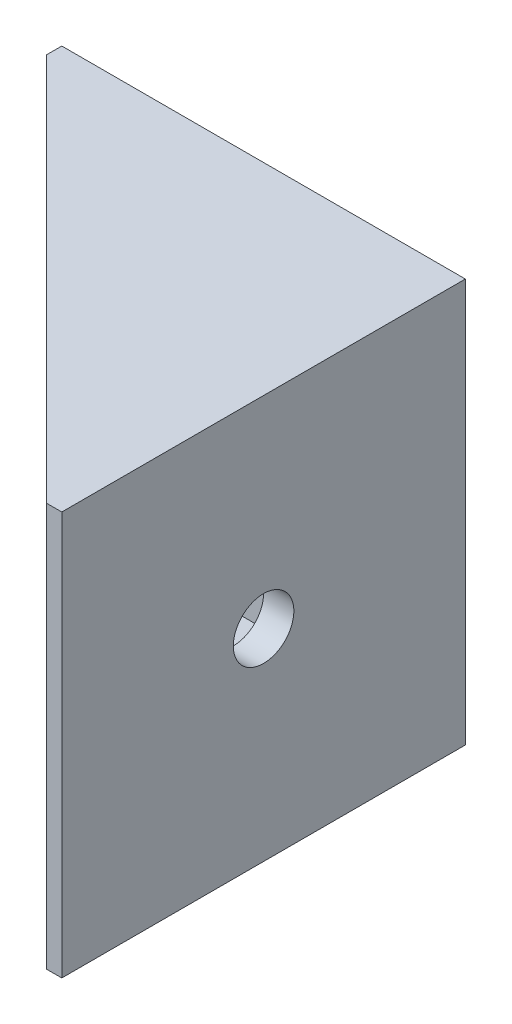
ISO-10303-21;
HEADER;
FILE_DESCRIPTION(('STEP AP214'),'2;1');
FILE_NAME('part.step','',(''),(''),'','','');
FILE_SCHEMA(('AUTOMOTIVE_DESIGN { 1 0 10303 214 1 1 1 1 }'));
ENDSEC;
DATA;
#1=APPLICATION_CONTEXT('core data for automotive mechanical design processes');
#2=APPLICATION_PROTOCOL_DEFINITION('international standard','automotive_design',2000,#1);
#3=PRODUCT_CONTEXT('',#1,'mechanical');
#4=PRODUCT('Part','Part','',(#3));
#5=PRODUCT_RELATED_PRODUCT_CATEGORY('part','',(#4));
#6=PRODUCT_DEFINITION_FORMATION('','',#4);
#7=PRODUCT_DEFINITION_CONTEXT('part definition',#1,'design');
#8=PRODUCT_DEFINITION('design','',#6,#7);
#9=PRODUCT_DEFINITION_SHAPE('','',#8);
#10=(LENGTH_UNIT() NAMED_UNIT(*) SI_UNIT(.MILLI.,.METRE.));
#11=(NAMED_UNIT(*) PLANE_ANGLE_UNIT() SI_UNIT($,.RADIAN.));
#12=(NAMED_UNIT(*) SI_UNIT($,.STERADIAN.) SOLID_ANGLE_UNIT());
#13=UNCERTAINTY_MEASURE_WITH_UNIT(LENGTH_MEASURE(1.E-05),#10,'distance_accuracy_value','');
#14=(GEOMETRIC_REPRESENTATION_CONTEXT(3) GLOBAL_UNCERTAINTY_ASSIGNED_CONTEXT((#13)) GLOBAL_UNIT_ASSIGNED_CONTEXT((#10,
#11,#12)) REPRESENTATION_CONTEXT('',''));
#15=CARTESIAN_POINT('',(0.,0.,0.));
#16=DIRECTION('',(0.,0.,1.));
#17=DIRECTION('',(1.,0.,0.));
#18=AXIS2_PLACEMENT_3D('',#15,#16,#17);
#19=CARTESIAN_POINT('',(-38.5,20.,3.));
#20=DIRECTION('',(0.,0.,-1.));
#21=DIRECTION('',(-1.,0.,0.));
#22=AXIS2_PLACEMENT_3D('',#19,#20,#21);
#23=PLANE('',#22);
#24=CARTESIAN_POINT('',(-20.,0.,3.00000000000001));
#25=DIRECTION('',(0.,0.,-1.));
#26=DIRECTION('',(-1.,0.,0.));
#27=AXIS2_PLACEMENT_3D('',#24,#25,#26);
#28=CIRCLE('',#27,3.);
#29=CARTESIAN_POINT('',(-23.,0.,3.00000000000001));
#30=VERTEX_POINT('',#29);
#31=EDGE_CURVE('E124',#30,#30,#28,.T.);
#32=ORIENTED_EDGE('',*,*,#31,.T.);
#33=EDGE_LOOP('',(#32));
#34=FACE_BOUND('',#33,.T.);
#35=DIRECTION('',(1.,0.,0.));
#36=VECTOR('',#35,1.);
#37=CARTESIAN_POINT('',(-3.00000000000001,17.,3.));
#38=LINE('',#37,#36);
#39=CARTESIAN_POINT('',(-38.5,17.,3.));
#40=VERTEX_POINT('',#39);
#41=CARTESIAN_POINT('',(-3.00000000000001,17.,3.));
#42=VERTEX_POINT('',#41);
#43=EDGE_CURVE('E104',#40,#42,#38,.T.);
#44=ORIENTED_EDGE('',*,*,#43,.F.);
#45=DIRECTION('',(0.,-1.,0.));
#46=VECTOR('',#45,1.);
#47=CARTESIAN_POINT('',(-38.5,20.,3.));
#48=LINE('',#47,#46);
#49=CARTESIAN_POINT('',(-38.5,-17.,3.));
#50=VERTEX_POINT('',#49);
#51=EDGE_CURVE('E50',#40,#50,#48,.T.);
#52=ORIENTED_EDGE('',*,*,#51,.T.);
#53=DIRECTION('',(1.,0.,0.));
#54=VECTOR('',#53,1.);
#55=CARTESIAN_POINT('',(-3.00000000000001,-17.,3.));
#56=LINE('',#55,#54);
#57=CARTESIAN_POINT('',(-3.00000000000001,-17.,3.));
#58=VERTEX_POINT('',#57);
#59=EDGE_CURVE('E172',#50,#58,#56,.T.);
#60=ORIENTED_EDGE('',*,*,#59,.T.);
#61=DIRECTION('',(0.,-1.,0.));
#62=VECTOR('',#61,1.);
#63=CARTESIAN_POINT('',(-3.00000000000001,20.,3.));
#64=LINE('',#63,#62);
#65=EDGE_CURVE('E58',#42,#58,#64,.T.);
#66=ORIENTED_EDGE('',*,*,#65,.F.);
#67=EDGE_LOOP('',(#44,#52,#60,#66));
#68=FACE_BOUND('',#67,.T.);
#69=ADVANCED_FACE('F33',(#34,#68),#23,.F.);
#70=CARTESIAN_POINT('',(-3.00000000000001,20.,3.));
#71=DIRECTION('',(1.,0.,0.));
#72=DIRECTION('',(0.,0.,-1.));
#73=AXIS2_PLACEMENT_3D('',#70,#71,#72);
#74=PLANE('',#73);
#75=CARTESIAN_POINT('',(-3.00000000000001,0.,20.));
#76=DIRECTION('',(1.,0.,0.));
#77=DIRECTION('',(0.,0.,-1.));
#78=AXIS2_PLACEMENT_3D('',#75,#76,#77);
#79=CIRCLE('',#78,3.);
#80=CARTESIAN_POINT('',(-3.00000000000001,0.,17.));
#81=VERTEX_POINT('',#80);
#82=EDGE_CURVE('E37',#81,#81,#79,.T.);
#83=ORIENTED_EDGE('',*,*,#82,.T.);
#84=EDGE_LOOP('',(#83));
#85=FACE_BOUND('',#84,.T.);
#86=DIRECTION('',(0.,0.,1.));
#87=VECTOR('',#86,1.);
#88=CARTESIAN_POINT('',(-3.,17.,38.5));
#89=LINE('',#88,#87);
#90=CARTESIAN_POINT('',(-3.,17.,38.5));
#91=VERTEX_POINT('',#90);
#92=EDGE_CURVE('E105',#42,#91,#89,.T.);
#93=ORIENTED_EDGE('',*,*,#92,.F.);
#94=ORIENTED_EDGE('',*,*,#65,.T.);
#95=DIRECTION('',(0.,0.,1.));
#96=VECTOR('',#95,1.);
#97=CARTESIAN_POINT('',(-3.,-17.,38.5));
#98=LINE('',#97,#96);
#99=CARTESIAN_POINT('',(-3.,-17.,38.5));
#100=VERTEX_POINT('',#99);
#101=EDGE_CURVE('E169',#58,#100,#98,.T.);
#102=ORIENTED_EDGE('',*,*,#101,.T.);
#103=DIRECTION('',(0.,-1.,0.));
#104=VECTOR('',#103,1.);
#105=CARTESIAN_POINT('',(-3.,20.,38.5));
#106=LINE('',#105,#104);
#107=EDGE_CURVE('E119',#91,#100,#106,.T.);
#108=ORIENTED_EDGE('',*,*,#107,.F.);
#109=EDGE_LOOP('',(#93,#94,#102,#108));
#110=FACE_BOUND('',#109,.T.);
#111=ADVANCED_FACE('F170',(#85,#110),#74,.F.);
#112=CARTESIAN_POINT('',(0.,20.,40.));
#113=DIRECTION('',(-1.,0.,0.));
#114=DIRECTION('',(0.,0.,1.));
#115=AXIS2_PLACEMENT_3D('',#112,#113,#114);
#116=PLANE('',#115);
#117=CARTESIAN_POINT('',(0.,0.,20.));
#118=DIRECTION('',(-1.,0.,0.));
#119=DIRECTION('',(0.,0.,1.));
#120=AXIS2_PLACEMENT_3D('',#117,#118,#119);
#121=CIRCLE('',#120,3.);
#122=CARTESIAN_POINT('',(0.,0.,23.));
#123=VERTEX_POINT('',#122);
#124=EDGE_CURVE('E127',#123,#123,#121,.T.);
#125=ORIENTED_EDGE('',*,*,#124,.T.);
#126=EDGE_LOOP('',(#125));
#127=FACE_BOUND('',#126,.T.);
#128=DIRECTION('',(0.,0.,-1.));
#129=VECTOR('',#128,1.);
#130=CARTESIAN_POINT('',(0.,-20.,40.));
#131=LINE('',#130,#129);
#132=CARTESIAN_POINT('',(0.,-20.,40.));
#133=VERTEX_POINT('',#132);
#134=CARTESIAN_POINT('',(0.,-20.,0.));
#135=VERTEX_POINT('',#134);
#136=EDGE_CURVE('E131',#133,#135,#131,.T.);
#137=ORIENTED_EDGE('',*,*,#136,.T.);
#138=DIRECTION('',(0.,-1.,0.));
#139=VECTOR('',#138,1.);
#140=CARTESIAN_POINT('',(0.,20.,0.));
#141=LINE('',#140,#139);
#142=CARTESIAN_POINT('',(0.,20.,0.));
#143=VERTEX_POINT('',#142);
#144=EDGE_CURVE('E11',#143,#135,#141,.T.);
#145=ORIENTED_EDGE('',*,*,#144,.F.);
#146=DIRECTION('',(0.,0.,-1.));
#147=VECTOR('',#146,1.);
#148=CARTESIAN_POINT('',(0.,20.,40.));
#149=LINE('',#148,#147);
#150=CARTESIAN_POINT('',(0.,20.,40.));
#151=VERTEX_POINT('',#150);
#152=EDGE_CURVE('E141',#151,#143,#149,.T.);
#153=ORIENTED_EDGE('',*,*,#152,.F.);
#154=DIRECTION('',(0.,-1.,0.));
#155=VECTOR('',#154,1.);
#156=CARTESIAN_POINT('',(0.,20.,40.));
#157=LINE('',#156,#155);
#158=EDGE_CURVE('E153',#151,#133,#157,.T.);
#159=ORIENTED_EDGE('',*,*,#158,.T.);
#160=EDGE_LOOP('',(#137,#145,#153,#159));
#161=FACE_BOUND('',#160,.T.);
#162=ADVANCED_FACE('F35',(#127,#161),#116,.F.);
#163=CARTESIAN_POINT('',(0.,20.,0.));
#164=DIRECTION('',(0.,0.,1.));
#165=DIRECTION('',(1.,0.,0.));
#166=AXIS2_PLACEMENT_3D('',#163,#164,#165);
#167=PLANE('',#166);
#168=CARTESIAN_POINT('',(-20.,0.,0.));
#169=DIRECTION('',(0.,0.,1.));
#170=DIRECTION('',(1.,0.,0.));
#171=AXIS2_PLACEMENT_3D('',#168,#169,#170);
#172=CIRCLE('',#171,3.);
#173=CARTESIAN_POINT('',(-17.,0.,0.));
#174=VERTEX_POINT('',#173);
#175=EDGE_CURVE('E126',#174,#174,#172,.T.);
#176=ORIENTED_EDGE('',*,*,#175,.T.);
#177=EDGE_LOOP('',(#176));
#178=FACE_BOUND('',#177,.T.);
#179=DIRECTION('',(-1.,0.,0.));
#180=VECTOR('',#179,1.);
#181=CARTESIAN_POINT('',(0.,-20.,0.));
#182=LINE('',#181,#180);
#183=CARTESIAN_POINT('',(-40.,-20.,0.));
#184=VERTEX_POINT('',#183);
#185=EDGE_CURVE('E156',#135,#184,#182,.T.);
#186=ORIENTED_EDGE('',*,*,#185,.T.);
#187=DIRECTION('',(0.,-1.,0.));
#188=VECTOR('',#187,1.);
#189=CARTESIAN_POINT('',(-40.,20.,0.));
#190=LINE('',#189,#188);
#191=CARTESIAN_POINT('',(-40.,20.,0.));
#192=VERTEX_POINT('',#191);
#193=EDGE_CURVE('E42',#192,#184,#190,.T.);
#194=ORIENTED_EDGE('',*,*,#193,.F.);
#195=DIRECTION('',(-1.,0.,0.));
#196=VECTOR('',#195,1.);
#197=CARTESIAN_POINT('',(0.,20.,0.));
#198=LINE('',#197,#196);
#199=EDGE_CURVE('E144',#143,#192,#198,.T.);
#200=ORIENTED_EDGE('',*,*,#199,.F.);
#201=ORIENTED_EDGE('',*,*,#144,.T.);
#202=EDGE_LOOP('',(#186,#194,#200,#201));
#203=FACE_BOUND('',#202,.T.);
#204=ADVANCED_FACE('F198',(#178,#203),#167,.F.);
#205=CARTESIAN_POINT('',(-40.,20.,0.));
#206=DIRECTION('',(1.,0.,0.));
#207=DIRECTION('',(0.,0.,-1.));
#208=AXIS2_PLACEMENT_3D('',#205,#206,#207);
#209=PLANE('',#208);
#210=DIRECTION('',(0.,0.,1.));
#211=VECTOR('',#210,1.);
#212=CARTESIAN_POINT('',(-40.,-20.,0.));
#213=LINE('',#212,#211);
#214=CARTESIAN_POINT('',(-40.,-20.,1.50000000000001));
#215=VERTEX_POINT('',#214);
#216=EDGE_CURVE('E158',#184,#215,#213,.T.);
#217=ORIENTED_EDGE('',*,*,#216,.T.);
#218=DIRECTION('',(0.,-1.,0.));
#219=VECTOR('',#218,1.);
#220=CARTESIAN_POINT('',(-40.,20.,1.50000000000001));
#221=LINE('',#220,#219);
#222=CARTESIAN_POINT('',(-40.,20.,1.50000000000001));
#223=VERTEX_POINT('',#222);
#224=EDGE_CURVE('E115',#223,#215,#221,.T.);
#225=ORIENTED_EDGE('',*,*,#224,.F.);
#226=DIRECTION('',(0.,0.,1.));
#227=VECTOR('',#226,1.);
#228=CARTESIAN_POINT('',(-40.,20.,0.));
#229=LINE('',#228,#227);
#230=EDGE_CURVE('E147',#192,#223,#229,.T.);
#231=ORIENTED_EDGE('',*,*,#230,.F.);
#232=ORIENTED_EDGE('',*,*,#193,.T.);
#233=EDGE_LOOP('',(#217,#225,#231,#232));
#234=FACE_BOUND('',#233,.T.);
#235=ADVANCED_FACE('F196',(#234),#209,.F.);
#236=CARTESIAN_POINT('',(-3.,20.,38.5));
#237=DIRECTION('',(0.707106781186545,0.,-0.70710678118655));
#238=DIRECTION('',(-0.70710678118655,0.,-0.707106781186545));
#239=AXIS2_PLACEMENT_3D('',#236,#237,#238);
#240=PLANE('',#239);
#241=ORIENTED_EDGE('',*,*,#51,.F.);
#242=DIRECTION('',(-0.707106781186547,0.,-0.707106781186547));
#243=VECTOR('',#242,1.);
#244=CARTESIAN_POINT('',(-38.5,17.,3.));
#245=LINE('',#244,#243);
#246=EDGE_CURVE('E102',#91,#40,#245,.T.);
#247=ORIENTED_EDGE('',*,*,#246,.F.);
#248=ORIENTED_EDGE('',*,*,#107,.T.);
#249=DIRECTION('',(-0.707106781186547,0.,-0.707106781186547));
#250=VECTOR('',#249,1.);
#251=CARTESIAN_POINT('',(-38.5,-17.,3.));
#252=LINE('',#251,#250);
#253=EDGE_CURVE('E114',#100,#50,#252,.T.);
#254=ORIENTED_EDGE('',*,*,#253,.T.);
#255=EDGE_LOOP('',(#241,#247,#248,#254));
#256=FACE_BOUND('',#255,.T.);
#257=DIRECTION('',(0.70710678118655,0.,0.707106781186545));
#258=VECTOR('',#257,1.);
#259=CARTESIAN_POINT('',(-3.,-20.,38.5));
#260=LINE('',#259,#258);
#261=CARTESIAN_POINT('',(-1.5,-20.,40.));
#262=VERTEX_POINT('',#261);
#263=EDGE_CURVE('E161',#215,#262,#260,.T.);
#264=ORIENTED_EDGE('',*,*,#263,.T.);
#265=DIRECTION('',(0.,-1.,0.));
#266=VECTOR('',#265,1.);
#267=CARTESIAN_POINT('',(-1.5,20.,40.));
#268=LINE('',#267,#266);
#269=CARTESIAN_POINT('',(-1.5,20.,40.));
#270=VERTEX_POINT('',#269);
#271=EDGE_CURVE('E166',#270,#262,#268,.T.);
#272=ORIENTED_EDGE('',*,*,#271,.F.);
#273=DIRECTION('',(0.707106781186546,0.,0.707106781186549));
#274=VECTOR('',#273,1.);
#275=CARTESIAN_POINT('',(-40.,20.,1.50000000000001));
#276=LINE('',#275,#274);
#277=EDGE_CURVE('E149',#223,#270,#276,.T.);
#278=ORIENTED_EDGE('',*,*,#277,.F.);
#279=ORIENTED_EDGE('',*,*,#224,.T.);
#280=EDGE_LOOP('',(#264,#272,#278,#279));
#281=FACE_BOUND('',#280,.T.);
#282=ADVANCED_FACE('F111',(#256,#281),#240,.F.);
#283=CARTESIAN_POINT('',(-1.5,20.,40.));
#284=DIRECTION('',(0.,0.,-1.));
#285=DIRECTION('',(-1.,0.,0.));
#286=AXIS2_PLACEMENT_3D('',#283,#284,#285);
#287=PLANE('',#286);
#288=DIRECTION('',(1.,0.,0.));
#289=VECTOR('',#288,1.);
#290=CARTESIAN_POINT('',(-1.5,-20.,40.));
#291=LINE('',#290,#289);
#292=EDGE_CURVE('E145',#262,#133,#291,.T.);
#293=ORIENTED_EDGE('',*,*,#292,.T.);
#294=ORIENTED_EDGE('',*,*,#158,.F.);
#295=DIRECTION('',(1.,0.,0.));
#296=VECTOR('',#295,1.);
#297=CARTESIAN_POINT('',(-1.5,20.,40.));
#298=LINE('',#297,#296);
#299=EDGE_CURVE('E151',#270,#151,#298,.T.);
#300=ORIENTED_EDGE('',*,*,#299,.F.);
#301=ORIENTED_EDGE('',*,*,#271,.T.);
#302=EDGE_LOOP('',(#293,#294,#300,#301));
#303=FACE_BOUND('',#302,.T.);
#304=ADVANCED_FACE('F220',(#303),#287,.F.);
#305=CARTESIAN_POINT('',(0.,20.,0.));
#306=DIRECTION('',(0.,1.,0.));
#307=DIRECTION('',(0.,0.,1.));
#308=AXIS2_PLACEMENT_3D('',#305,#306,#307);
#309=PLANE('',#308);
#310=ORIENTED_EDGE('',*,*,#152,.T.);
#311=ORIENTED_EDGE('',*,*,#199,.T.);
#312=ORIENTED_EDGE('',*,*,#230,.T.);
#313=ORIENTED_EDGE('',*,*,#277,.T.);
#314=ORIENTED_EDGE('',*,*,#299,.T.);
#315=EDGE_LOOP('',(#310,#311,#312,#313,#314));
#316=FACE_BOUND('',#315,.T.);
#317=ADVANCED_FACE('F224',(#316),#309,.T.);
#318=CARTESIAN_POINT('',(0.,-20.,0.));
#319=DIRECTION('',(0.,1.,0.));
#320=DIRECTION('',(0.,0.,1.));
#321=AXIS2_PLACEMENT_3D('',#318,#319,#320);
#322=PLANE('',#321);
#323=ORIENTED_EDGE('',*,*,#136,.F.);
#324=ORIENTED_EDGE('',*,*,#292,.F.);
#325=ORIENTED_EDGE('',*,*,#263,.F.);
#326=ORIENTED_EDGE('',*,*,#216,.F.);
#327=ORIENTED_EDGE('',*,*,#185,.F.);
#328=EDGE_LOOP('',(#323,#324,#325,#326,#327));
#329=FACE_BOUND('',#328,.T.);
#330=ADVANCED_FACE('F214',(#329),#322,.F.);
#331=CARTESIAN_POINT('',(-20.,0.,-17.));
#332=DIRECTION('',(0.,0.,1.));
#333=DIRECTION('',(1.,0.,0.));
#334=AXIS2_PLACEMENT_3D('',#331,#332,#333);
#335=CYLINDRICAL_SURFACE('',#334,3.);
#336=ORIENTED_EDGE('',*,*,#31,.F.);
#337=EDGE_LOOP('',(#336));
#338=FACE_BOUND('',#337,.T.);
#339=ORIENTED_EDGE('',*,*,#175,.F.);
#340=EDGE_LOOP('',(#339));
#341=FACE_BOUND('',#340,.T.);
#342=ADVANCED_FACE('F184',(#338,#341),#335,.F.);
#343=CARTESIAN_POINT('',(17.,0.,20.));
#344=DIRECTION('',(-1.,0.,0.));
#345=DIRECTION('',(0.,0.,1.));
#346=AXIS2_PLACEMENT_3D('',#343,#344,#345);
#347=CYLINDRICAL_SURFACE('',#346,3.);
#348=ORIENTED_EDGE('',*,*,#82,.F.);
#349=EDGE_LOOP('',(#348));
#350=FACE_BOUND('',#349,.T.);
#351=ORIENTED_EDGE('',*,*,#124,.F.);
#352=EDGE_LOOP('',(#351));
#353=FACE_BOUND('',#352,.T.);
#354=ADVANCED_FACE('F177',(#350,#353),#347,.F.);
#355=CARTESIAN_POINT('',(0.,-17.,0.));
#356=DIRECTION('',(0.,-1.,0.));
#357=DIRECTION('',(0.,0.,-1.));
#358=AXIS2_PLACEMENT_3D('',#355,#356,#357);
#359=PLANE('',#358);
#360=ORIENTED_EDGE('',*,*,#59,.F.);
#361=ORIENTED_EDGE('',*,*,#253,.F.);
#362=ORIENTED_EDGE('',*,*,#101,.F.);
#363=EDGE_LOOP('',(#360,#361,#362));
#364=FACE_BOUND('',#363,.T.);
#365=ADVANCED_FACE('F173',(#364),#359,.F.);
#366=CARTESIAN_POINT('',(0.,17.,0.));
#367=DIRECTION('',(0.,1.,0.));
#368=DIRECTION('',(0.,0.,-1.));
#369=AXIS2_PLACEMENT_3D('',#366,#367,#368);
#370=PLANE('',#369);
#371=ORIENTED_EDGE('',*,*,#43,.T.);
#372=ORIENTED_EDGE('',*,*,#92,.T.);
#373=ORIENTED_EDGE('',*,*,#246,.T.);
#374=EDGE_LOOP('',(#371,#372,#373));
#375=FACE_BOUND('',#374,.T.);
#376=ADVANCED_FACE('F103',(#375),#370,.F.);
#377=CLOSED_SHELL('',(#69,#111,#162,#204,#235,#282,#304,#317,#330,#342,#354,#365,#376));
#378=MANIFOLD_SOLID_BREP('B2',#377);
#379=ADVANCED_BREP_SHAPE_REPRESENTATION('',(#18,#378),#14);
#380=SHAPE_DEFINITION_REPRESENTATION(#9,#379);
ENDSEC;
END-ISO-10303-21;
